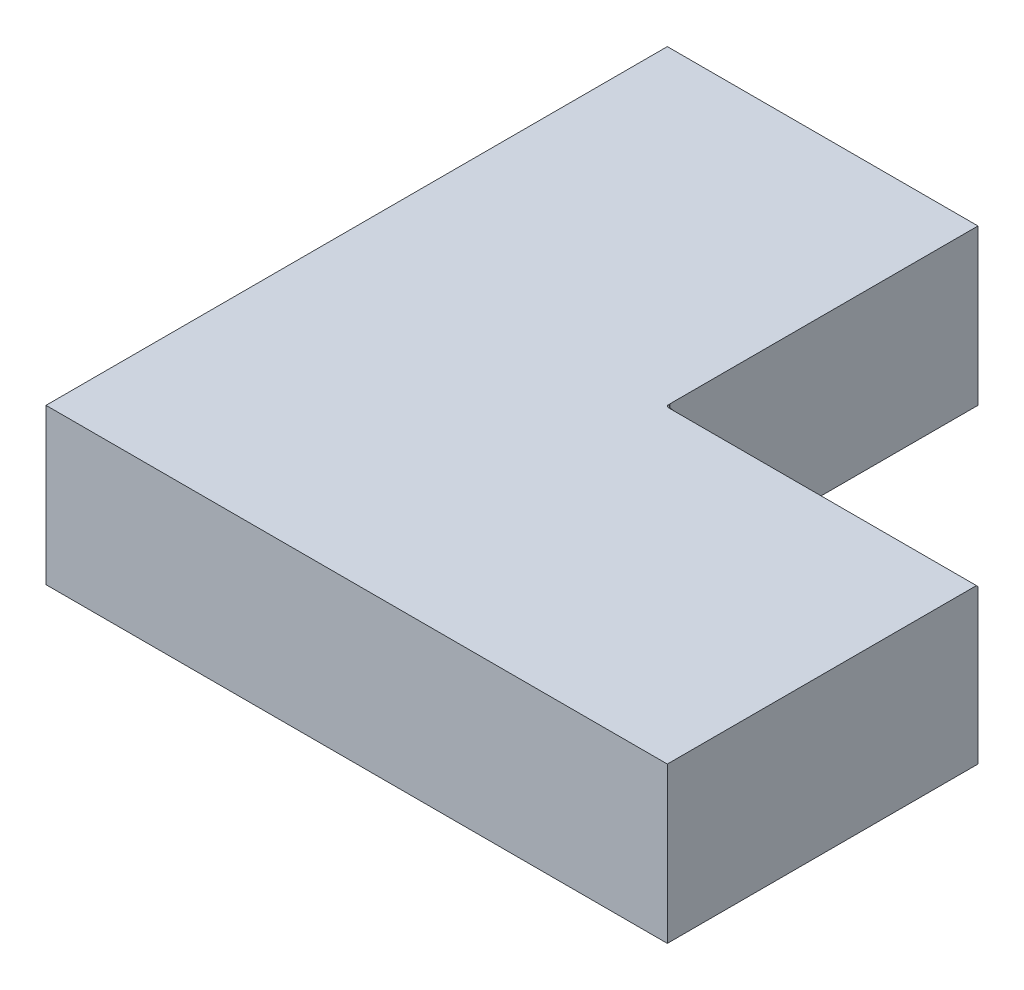
ISO-10303-21;
HEADER;
FILE_DESCRIPTION(('STEP AP214'),'2;1');
FILE_NAME('part.step','',(''),(''),'','','');
FILE_SCHEMA(('AUTOMOTIVE_DESIGN { 1 0 10303 214 1 1 1 1 }'));
ENDSEC;
DATA;
#1=APPLICATION_CONTEXT('core data for automotive mechanical design processes');
#2=APPLICATION_PROTOCOL_DEFINITION('international standard','automotive_design',2000,#1);
#3=PRODUCT_CONTEXT('',#1,'mechanical');
#4=PRODUCT('Part','Part','',(#3));
#5=PRODUCT_RELATED_PRODUCT_CATEGORY('part','',(#4));
#6=PRODUCT_DEFINITION_FORMATION('','',#4);
#7=PRODUCT_DEFINITION_CONTEXT('part definition',#1,'design');
#8=PRODUCT_DEFINITION('design','',#6,#7);
#9=PRODUCT_DEFINITION_SHAPE('','',#8);
#10=(LENGTH_UNIT() NAMED_UNIT(*) SI_UNIT(.MILLI.,.METRE.));
#11=(NAMED_UNIT(*) PLANE_ANGLE_UNIT() SI_UNIT($,.RADIAN.));
#12=(NAMED_UNIT(*) SI_UNIT($,.STERADIAN.) SOLID_ANGLE_UNIT());
#13=UNCERTAINTY_MEASURE_WITH_UNIT(LENGTH_MEASURE(1.E-05),#10,'distance_accuracy_value','');
#14=(GEOMETRIC_REPRESENTATION_CONTEXT(3) GLOBAL_UNCERTAINTY_ASSIGNED_CONTEXT((#13)) GLOBAL_UNIT_ASSIGNED_CONTEXT((#10,
#11,#12)) REPRESENTATION_CONTEXT('',''));
#15=CARTESIAN_POINT('',(0.,0.,0.));
#16=DIRECTION('',(0.,0.,1.));
#17=DIRECTION('',(1.,0.,0.));
#18=AXIS2_PLACEMENT_3D('',#15,#16,#17);
#19=CARTESIAN_POINT('',(20.,10.,20.));
#20=DIRECTION('',(-1.,0.,0.));
#21=DIRECTION('',(0.,0.,1.));
#22=AXIS2_PLACEMENT_3D('',#19,#20,#21);
#23=PLANE('',#22);
#24=DIRECTION('',(0.,0.707106781186546,0.707106781186549));
#25=VECTOR('',#24,1.);
#26=CARTESIAN_POINT('',(20.,19.95,10.05));
#27=LINE('',#26,#25);
#28=CARTESIAN_POINT('',(20.,10.,0.100000000000001));
#29=VERTEX_POINT('',#28);
#30=CARTESIAN_POINT('',(20.,9.9,0.));
#31=VERTEX_POINT('',#30);
#32=EDGE_CURVE('E116',#29,#31,#27,.F.);
#33=ORIENTED_EDGE('',*,*,#32,.F.);
#34=DIRECTION('',(0.,0.,-1.));
#35=VECTOR('',#34,1.);
#36=CARTESIAN_POINT('',(20.,10.,20.));
#37=LINE('',#36,#35);
#38=CARTESIAN_POINT('',(20.,10.,20.));
#39=VERTEX_POINT('',#38);
#40=EDGE_CURVE('E193',#39,#29,#37,.T.);
#41=ORIENTED_EDGE('',*,*,#40,.F.);
#42=DIRECTION('',(0.,-1.,0.));
#43=VECTOR('',#42,1.);
#44=CARTESIAN_POINT('',(20.,10.,20.));
#45=LINE('',#44,#43);
#46=CARTESIAN_POINT('',(20.,0.,20.));
#47=VERTEX_POINT('',#46);
#48=EDGE_CURVE('E128',#39,#47,#45,.T.);
#49=ORIENTED_EDGE('',*,*,#48,.T.);
#50=DIRECTION('',(0.,0.,-1.));
#51=VECTOR('',#50,1.);
#52=CARTESIAN_POINT('',(20.,0.,20.));
#53=LINE('',#52,#51);
#54=CARTESIAN_POINT('',(20.,0.,0.));
#55=VERTEX_POINT('',#54);
#56=EDGE_CURVE('E126',#47,#55,#53,.T.);
#57=ORIENTED_EDGE('',*,*,#56,.T.);
#58=DIRECTION('',(0.,-1.,0.));
#59=VECTOR('',#58,1.);
#60=CARTESIAN_POINT('',(20.,10.,0.));
#61=LINE('',#60,#59);
#62=EDGE_CURVE('E107',#31,#55,#61,.T.);
#63=ORIENTED_EDGE('',*,*,#62,.F.);
#64=EDGE_LOOP('',(#33,#41,#49,#57,#63));
#65=FACE_BOUND('',#64,.T.);
#66=ADVANCED_FACE('F33',(#65),#23,.F.);
#67=CARTESIAN_POINT('',(20.,10.,0.));
#68=DIRECTION('',(0.,0.,1.));
#69=DIRECTION('',(1.,0.,0.));
#70=AXIS2_PLACEMENT_3D('',#67,#68,#69);
#71=PLANE('',#70);
#72=DIRECTION('',(0.,-1.,0.));
#73=VECTOR('',#72,1.);
#74=CARTESIAN_POINT('',(0.200000000000004,10.,0.));
#75=LINE('',#74,#73);
#76=CARTESIAN_POINT('',(0.200000000000002,0.,0.));
#77=VERTEX_POINT('',#76);
#78=CARTESIAN_POINT('',(0.200000000000004,9.9429660983644,0.));
#79=VERTEX_POINT('',#78);
#80=EDGE_CURVE('E56',#77,#79,#75,.F.);
#81=ORIENTED_EDGE('',*,*,#80,.T.);
#82=CARTESIAN_POINT('',(0.,10.3242640687119,0.));
#83=DIRECTION('',(0.,0.,1.));
#84=DIRECTION('',(-0.923879532511287,0.382683432365089,0.));
#85=AXIS2_PLACEMENT_3D('',#82,#83,#84);
#86=ELLIPSE('',#85,0.839379795579543,0.3);
#87=CARTESIAN_POINT('',(0.512132034355971,9.9,0.));
#88=VERTEX_POINT('',#87);
#89=EDGE_CURVE('E42',#79,#88,#86,.T.);
#90=ORIENTED_EDGE('',*,*,#89,.T.);
#91=DIRECTION('',(1.,0.,0.));
#92=VECTOR('',#91,1.);
#93=CARTESIAN_POINT('',(20.,9.9,0.));
#94=LINE('',#93,#92);
#95=EDGE_CURVE('E103',#88,#31,#94,.T.);
#96=ORIENTED_EDGE('',*,*,#95,.T.);
#97=ORIENTED_EDGE('',*,*,#62,.T.);
#98=DIRECTION('',(-1.,0.,0.));
#99=VECTOR('',#98,1.);
#100=CARTESIAN_POINT('',(20.,0.,0.));
#101=LINE('',#100,#99);
#102=EDGE_CURVE('E212',#55,#77,#101,.T.);
#103=ORIENTED_EDGE('',*,*,#102,.T.);
#104=EDGE_LOOP('',(#81,#90,#96,#97,#103));
#105=FACE_BOUND('',#104,.T.);
#106=ADVANCED_FACE('F105',(#105),#71,.F.);
#107=CARTESIAN_POINT('',(0.,10.,0.));
#108=DIRECTION('',(0.,-1.,0.));
#109=DIRECTION('',(0.,0.,-1.));
#110=AXIS2_PLACEMENT_3D('',#107,#108,#109);
#111=PLANE('',#110);
#112=DIRECTION('',(-1.,0.,0.));
#113=VECTOR('',#112,1.);
#114=CARTESIAN_POINT('',(0.,10.,0.0999999999999998));
#115=LINE('',#114,#113);
#116=CARTESIAN_POINT('',(0.270710678118661,10.,0.0999999999999998));
#117=VERTEX_POINT('',#116);
#118=EDGE_CURVE('E113',#117,#29,#115,.F.);
#119=ORIENTED_EDGE('',*,*,#118,.F.);
#120=CARTESIAN_POINT('',(0.782842712474628,10.,-0.32426406871193));
#121=DIRECTION('',(0.,-1.,0.));
#122=DIRECTION('',(-0.923879532511287,0.,0.38268343236509));
#123=AXIS2_PLACEMENT_3D('',#120,#121,#122);
#124=ELLIPSE('',#123,0.839379795579546,0.3);
#125=CARTESIAN_POINT('',(0.016381515811958,10.,-0.120726724146867));
#126=VERTEX_POINT('',#125);
#127=EDGE_CURVE('E11',#117,#126,#124,.T.);
#128=ORIENTED_EDGE('',*,*,#127,.T.);
#129=CARTESIAN_POINT('',(0.200000000000004,10.,-0.199999999999999));
#130=DIRECTION('',(0.,-1.,0.));
#131=DIRECTION('',(0.,0.,-1.));
#132=AXIS2_PLACEMENT_3D('',#129,#130,#131);
#133=CIRCLE('',#132,0.2);
#134=CARTESIAN_POINT('',(0.,10.,-0.199999999999999));
#135=VERTEX_POINT('',#134);
#136=EDGE_CURVE('E49',#126,#135,#133,.T.);
#137=ORIENTED_EDGE('',*,*,#136,.T.);
#138=DIRECTION('',(0.,0.,-1.));
#139=VECTOR('',#138,1.);
#140=CARTESIAN_POINT('',(0.,10.,-20.));
#141=LINE('',#140,#139);
#142=CARTESIAN_POINT('',(0.,10.,-20.));
#143=VERTEX_POINT('',#142);
#144=EDGE_CURVE('E203',#135,#143,#141,.T.);
#145=ORIENTED_EDGE('',*,*,#144,.T.);
#146=DIRECTION('',(-1.,0.,0.));
#147=VECTOR('',#146,1.);
#148=CARTESIAN_POINT('',(-20.,10.,-20.));
#149=LINE('',#148,#147);
#150=CARTESIAN_POINT('',(-20.,10.,-20.));
#151=VERTEX_POINT('',#150);
#152=EDGE_CURVE('E205',#143,#151,#149,.T.);
#153=ORIENTED_EDGE('',*,*,#152,.T.);
#154=DIRECTION('',(0.,0.,1.));
#155=VECTOR('',#154,1.);
#156=CARTESIAN_POINT('',(-20.,10.,20.));
#157=LINE('',#156,#155);
#158=CARTESIAN_POINT('',(-20.,10.,20.));
#159=VERTEX_POINT('',#158);
#160=EDGE_CURVE('E196',#151,#159,#157,.T.);
#161=ORIENTED_EDGE('',*,*,#160,.T.);
#162=DIRECTION('',(1.,0.,0.));
#163=VECTOR('',#162,1.);
#164=CARTESIAN_POINT('',(-20.,10.,20.));
#165=LINE('',#164,#163);
#166=EDGE_CURVE('E199',#159,#39,#165,.T.);
#167=ORIENTED_EDGE('',*,*,#166,.T.);
#168=ORIENTED_EDGE('',*,*,#40,.T.);
#169=EDGE_LOOP('',(#119,#128,#137,#145,#153,#161,#167,#168));
#170=FACE_BOUND('',#169,.T.);
#171=ADVANCED_FACE('F158',(#170),#111,.F.);
#172=CARTESIAN_POINT('',(0.200000000000004,10.,-0.199999999999999));
#173=DIRECTION('',(0.,1.,0.));
#174=DIRECTION('',(0.,0.,1.));
#175=AXIS2_PLACEMENT_3D('',#172,#173,#174);
#176=CYLINDRICAL_SURFACE('',#175,0.2);
#177=ORIENTED_EDGE('',*,*,#136,.F.);
#178=CARTESIAN_POINT('',(0.016381515811958,10.,-0.120726724146867));
#179=CARTESIAN_POINT('',(0.0206265261656145,9.99560659978795,-0.110842482207147));
#180=CARTESIAN_POINT('',(0.0257730188420308,9.99160454893856,-0.10116153567028));
#181=CARTESIAN_POINT('',(0.0376930301719583,9.98431550293551,-0.0826327215866714));
#182=CARTESIAN_POINT('',(0.0444588993251442,9.98102528041823,-0.0737812017302279));
#183=CARTESIAN_POINT('',(0.0559632284967826,9.97645249582674,-0.0611151804677116));
#184=CARTESIAN_POINT('',(0.0601658894935687,9.97495166892114,-0.0568841173396201));
#185=CARTESIAN_POINT('',(0.0689596498259799,9.9720922047169,-0.0487911869032894));
#186=CARTESIAN_POINT('',(0.073550880568263,9.97073361587066,-0.0449294454403768));
#187=CARTESIAN_POINT('',(0.087365456668343,9.96696169940007,-0.0343405030258025));
#188=CARTESIAN_POINT('',(0.0970499504776735,9.96469529373639,-0.0281498531329492));
#189=CARTESIAN_POINT('',(0.117379596966192,9.96032258476404,-0.0175005899263898));
#190=CARTESIAN_POINT('',(0.128026502068652,9.95821658692299,-0.0130452179138755));
#191=CARTESIAN_POINT('',(0.148857940091571,9.95409131865113,-0.0063712428393559));
#192=CARTESIAN_POINT('',(0.158989433528346,9.9520829917738,-0.00397957995080242));
#193=CARTESIAN_POINT('',(0.179430945331591,9.94778336816035,-0.000788907929851369));
#194=CARTESIAN_POINT('',(0.189740798468612,9.94549232240394,1.1503164262596E-05));
#195=CARTESIAN_POINT('',(0.200000000000004,9.9429660983644,0.));
#196=B_SPLINE_CURVE_WITH_KNOTS('',3,(#178,#179,#180,#181,#182,#183,#184,#185,#186,#187,#188,
#189,#190,#191,#192,#193,#194,#195),.UNSPECIFIED.,.F.,.F.,(4,2,2,2,2,2,2,2,4),(0.,
0.0348374122283472,0.0695134014847629,0.087938991749202,0.106370838277666,0.141334582308125,
0.176363324955581,0.208044736966281,0.2396982238895),.UNSPECIFIED.);
#197=EDGE_CURVE('E149',#126,#79,#196,.T.);
#198=ORIENTED_EDGE('',*,*,#197,.T.);
#199=ORIENTED_EDGE('',*,*,#80,.F.);
#200=CARTESIAN_POINT('',(0.200000000000004,0.,-0.199999999999999));
#201=DIRECTION('',(0.,-1.,0.));
#202=DIRECTION('',(0.,0.,-1.));
#203=AXIS2_PLACEMENT_3D('',#200,#201,#202);
#204=CIRCLE('',#203,0.2);
#205=CARTESIAN_POINT('',(0.,0.,-0.199999999999999));
#206=VERTEX_POINT('',#205);
#207=EDGE_CURVE('E144',#206,#77,#204,.F.);
#208=ORIENTED_EDGE('',*,*,#207,.F.);
#209=DIRECTION('',(0.,-1.,0.));
#210=VECTOR('',#209,1.);
#211=CARTESIAN_POINT('',(0.,0.,-0.199999999999999));
#212=LINE('',#211,#210);
#213=EDGE_CURVE('E140',#135,#206,#212,.T.);
#214=ORIENTED_EDGE('',*,*,#213,.F.);
#215=EDGE_LOOP('',(#177,#198,#199,#208,#214));
#216=FACE_BOUND('',#215,.T.);
#217=ADVANCED_FACE('F153',(#216),#176,.F.);
#218=CARTESIAN_POINT('',(-20.,10.,20.));
#219=DIRECTION('',(1.,0.,0.));
#220=DIRECTION('',(0.,0.,-1.));
#221=AXIS2_PLACEMENT_3D('',#218,#219,#220);
#222=PLANE('',#221);
#223=DIRECTION('',(0.,0.,1.));
#224=VECTOR('',#223,1.);
#225=CARTESIAN_POINT('',(-20.,0.,20.));
#226=LINE('',#225,#224);
#227=CARTESIAN_POINT('',(-20.,0.,-20.));
#228=VERTEX_POINT('',#227);
#229=CARTESIAN_POINT('',(-20.,0.,20.));
#230=VERTEX_POINT('',#229);
#231=EDGE_CURVE('E122',#228,#230,#226,.T.);
#232=ORIENTED_EDGE('',*,*,#231,.T.);
#233=DIRECTION('',(0.,-1.,0.));
#234=VECTOR('',#233,1.);
#235=CARTESIAN_POINT('',(-20.,10.,20.));
#236=LINE('',#235,#234);
#237=EDGE_CURVE('E131',#159,#230,#236,.T.);
#238=ORIENTED_EDGE('',*,*,#237,.F.);
#239=ORIENTED_EDGE('',*,*,#160,.F.);
#240=DIRECTION('',(0.,-1.,0.));
#241=VECTOR('',#240,1.);
#242=CARTESIAN_POINT('',(-20.,10.,-20.));
#243=LINE('',#242,#241);
#244=EDGE_CURVE('E134',#151,#228,#243,.T.);
#245=ORIENTED_EDGE('',*,*,#244,.T.);
#246=EDGE_LOOP('',(#232,#238,#239,#245));
#247=FACE_BOUND('',#246,.T.);
#248=ADVANCED_FACE('F157',(#247),#222,.F.);
#249=CARTESIAN_POINT('',(-20.,10.,20.));
#250=DIRECTION('',(0.,0.,-1.));
#251=DIRECTION('',(-1.,0.,0.));
#252=AXIS2_PLACEMENT_3D('',#249,#250,#251);
#253=PLANE('',#252);
#254=DIRECTION('',(1.,0.,0.));
#255=VECTOR('',#254,1.);
#256=CARTESIAN_POINT('',(-20.,0.,20.));
#257=LINE('',#256,#255);
#258=EDGE_CURVE('E209',#230,#47,#257,.T.);
#259=ORIENTED_EDGE('',*,*,#258,.T.);
#260=ORIENTED_EDGE('',*,*,#48,.F.);
#261=ORIENTED_EDGE('',*,*,#166,.F.);
#262=ORIENTED_EDGE('',*,*,#237,.T.);
#263=EDGE_LOOP('',(#259,#260,#261,#262));
#264=FACE_BOUND('',#263,.T.);
#265=ADVANCED_FACE('F161',(#264),#253,.F.);
#266=CARTESIAN_POINT('',(0.,10.,-20.));
#267=DIRECTION('',(-1.,0.,0.));
#268=DIRECTION('',(0.,0.,1.));
#269=AXIS2_PLACEMENT_3D('',#266,#267,#268);
#270=PLANE('',#269);
#271=ORIENTED_EDGE('',*,*,#144,.F.);
#272=ORIENTED_EDGE('',*,*,#213,.T.);
#273=DIRECTION('',(0.,0.,-1.));
#274=VECTOR('',#273,1.);
#275=CARTESIAN_POINT('',(0.,0.,-20.));
#276=LINE('',#275,#274);
#277=CARTESIAN_POINT('',(0.,0.,-20.));
#278=VERTEX_POINT('',#277);
#279=EDGE_CURVE('E214',#206,#278,#276,.T.);
#280=ORIENTED_EDGE('',*,*,#279,.T.);
#281=DIRECTION('',(0.,-1.,0.));
#282=VECTOR('',#281,1.);
#283=CARTESIAN_POINT('',(0.,10.,-20.));
#284=LINE('',#283,#282);
#285=EDGE_CURVE('E129',#143,#278,#284,.T.);
#286=ORIENTED_EDGE('',*,*,#285,.F.);
#287=EDGE_LOOP('',(#271,#272,#280,#286));
#288=FACE_BOUND('',#287,.T.);
#289=ADVANCED_FACE('F165',(#288),#270,.F.);
#290=CARTESIAN_POINT('',(-20.,10.,-20.));
#291=DIRECTION('',(0.,0.,1.));
#292=DIRECTION('',(1.,0.,0.));
#293=AXIS2_PLACEMENT_3D('',#290,#291,#292);
#294=PLANE('',#293);
#295=DIRECTION('',(-1.,0.,0.));
#296=VECTOR('',#295,1.);
#297=CARTESIAN_POINT('',(-20.,0.,-20.));
#298=LINE('',#297,#296);
#299=EDGE_CURVE('E200',#278,#228,#298,.T.);
#300=ORIENTED_EDGE('',*,*,#299,.T.);
#301=ORIENTED_EDGE('',*,*,#244,.F.);
#302=ORIENTED_EDGE('',*,*,#152,.F.);
#303=ORIENTED_EDGE('',*,*,#285,.T.);
#304=EDGE_LOOP('',(#300,#301,#302,#303));
#305=FACE_BOUND('',#304,.T.);
#306=ADVANCED_FACE('F173',(#305),#294,.F.);
#307=CARTESIAN_POINT('',(0.,0.,0.));
#308=DIRECTION('',(0.,-1.,0.));
#309=DIRECTION('',(0.,0.,-1.));
#310=AXIS2_PLACEMENT_3D('',#307,#308,#309);
#311=PLANE('',#310);
#312=ORIENTED_EDGE('',*,*,#231,.F.);
#313=ORIENTED_EDGE('',*,*,#299,.F.);
#314=ORIENTED_EDGE('',*,*,#279,.F.);
#315=ORIENTED_EDGE('',*,*,#207,.T.);
#316=ORIENTED_EDGE('',*,*,#102,.F.);
#317=ORIENTED_EDGE('',*,*,#56,.F.);
#318=ORIENTED_EDGE('',*,*,#258,.F.);
#319=EDGE_LOOP('',(#312,#313,#314,#315,#316,#317,#318));
#320=FACE_BOUND('',#319,.T.);
#321=ADVANCED_FACE('F177',(#320),#311,.T.);
#322=CARTESIAN_POINT('',(20.,9.9,0.));
#323=DIRECTION('',(0.,-0.707106781186549,0.707106781186546));
#324=DIRECTION('',(0.,-0.707106781186546,-0.707106781186549));
#325=AXIS2_PLACEMENT_3D('',#322,#323,#324);
#326=PLANE('',#325);
#327=ORIENTED_EDGE('',*,*,#95,.F.);
#328=DIRECTION('',(-0.862856209461017,0.357406744336592,0.357406744336593));
#329=VECTOR('',#328,1.);
#330=CARTESIAN_POINT('',(0.0691609371230026,10.0834846362132,0.183484636213186));
#331=LINE('',#330,#329);
#332=EDGE_CURVE('E147',#88,#117,#331,.T.);
#333=ORIENTED_EDGE('',*,*,#332,.T.);
#334=ORIENTED_EDGE('',*,*,#118,.T.);
#335=ORIENTED_EDGE('',*,*,#32,.T.);
#336=EDGE_LOOP('',(#327,#333,#334,#335));
#337=FACE_BOUND('',#336,.T.);
#338=ADVANCED_FACE('F117',(#337),#326,.F.);
#339=CARTESIAN_POINT('',(0.192517188596226,10.2445208382054,-0.0797432305064938));
#340=DIRECTION('',(-0.862856209461017,0.357406744336592,0.357406744336594));
#341=DIRECTION('',(0.38268343236509,0.,0.923879532511287));
#342=AXIS2_PLACEMENT_3D('',#339,#340,#341);
#343=CYLINDRICAL_SURFACE('',#342,0.3);
#344=ORIENTED_EDGE('',*,*,#127,.F.);
#345=ORIENTED_EDGE('',*,*,#332,.F.);
#346=ORIENTED_EDGE('',*,*,#89,.F.);
#347=ORIENTED_EDGE('',*,*,#197,.F.);
#348=EDGE_LOOP('',(#344,#345,#346,#347));
#349=FACE_BOUND('',#348,.T.);
#350=ADVANCED_FACE('F35',(#349),#343,.F.);
#351=CLOSED_SHELL('',(#66,#106,#171,#217,#248,#265,#289,#306,#321,#338,#350));
#352=MANIFOLD_SOLID_BREP('B2',#351);
#353=ADVANCED_BREP_SHAPE_REPRESENTATION('',(#18,#352),#14);
#354=SHAPE_DEFINITION_REPRESENTATION(#9,#353);
ENDSEC;
END-ISO-10303-21;
